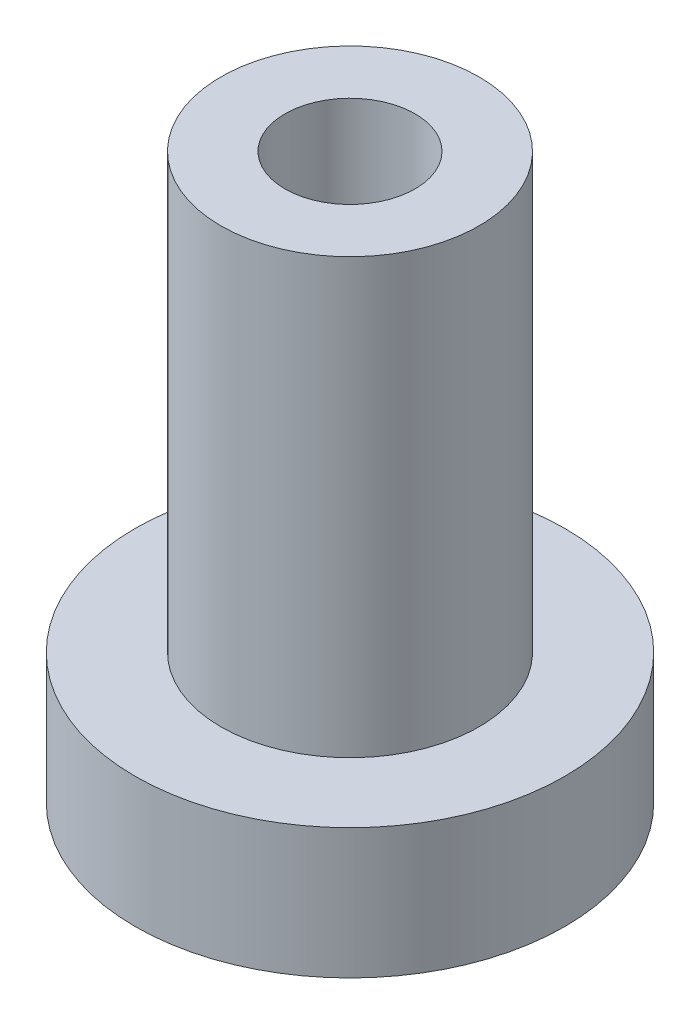
ISO-10303-21;
HEADER;
FILE_DESCRIPTION(('STEP AP214'),'2;1');
FILE_NAME('part.step','',(''),(''),'','','');
FILE_SCHEMA(('AUTOMOTIVE_DESIGN { 1 0 10303 214 1 1 1 1 }'));
ENDSEC;
DATA;
#1=APPLICATION_CONTEXT('core data for automotive mechanical design processes');
#2=APPLICATION_PROTOCOL_DEFINITION('international standard','automotive_design',2000,#1);
#3=PRODUCT_CONTEXT('',#1,'mechanical');
#4=PRODUCT('Part','Part','',(#3));
#5=PRODUCT_RELATED_PRODUCT_CATEGORY('part','',(#4));
#6=PRODUCT_DEFINITION_FORMATION('','',#4);
#7=PRODUCT_DEFINITION_CONTEXT('part definition',#1,'design');
#8=PRODUCT_DEFINITION('design','',#6,#7);
#9=PRODUCT_DEFINITION_SHAPE('','',#8);
#10=(LENGTH_UNIT() NAMED_UNIT(*) SI_UNIT(.MILLI.,.METRE.));
#11=(NAMED_UNIT(*) PLANE_ANGLE_UNIT() SI_UNIT($,.RADIAN.));
#12=(NAMED_UNIT(*) SI_UNIT($,.STERADIAN.) SOLID_ANGLE_UNIT());
#13=UNCERTAINTY_MEASURE_WITH_UNIT(LENGTH_MEASURE(1.E-05),#10,'distance_accuracy_value','');
#14=(GEOMETRIC_REPRESENTATION_CONTEXT(3) GLOBAL_UNCERTAINTY_ASSIGNED_CONTEXT((#13)) GLOBAL_UNIT_ASSIGNED_CONTEXT((#10,
#11,#12)) REPRESENTATION_CONTEXT('',''));
#15=CARTESIAN_POINT('',(0.,0.,0.));
#16=DIRECTION('',(0.,0.,1.));
#17=DIRECTION('',(1.,0.,0.));
#18=AXIS2_PLACEMENT_3D('',#15,#16,#17);
#19=CARTESIAN_POINT('',(0.,6.,0.));
#20=DIRECTION('',(0.,-1.,0.));
#21=DIRECTION('',(0.,0.,-1.));
#22=AXIS2_PLACEMENT_3D('',#19,#20,#21);
#23=CYLINDRICAL_SURFACE('',#22,9.9);
#24=CARTESIAN_POINT('',(0.,6.,0.));
#25=DIRECTION('',(0.,1.,0.));
#26=DIRECTION('',(0.,0.,1.));
#27=AXIS2_PLACEMENT_3D('',#24,#25,#26);
#28=CIRCLE('',#27,9.9);
#29=CARTESIAN_POINT('',(0.,6.,9.9));
#30=VERTEX_POINT('',#29);
#31=EDGE_CURVE('E38',#30,#30,#28,.T.);
#32=ORIENTED_EDGE('',*,*,#31,.F.);
#33=EDGE_LOOP('',(#32));
#34=FACE_BOUND('',#33,.T.);
#35=CARTESIAN_POINT('',(0.,0.,0.));
#36=DIRECTION('',(0.,1.,0.));
#37=DIRECTION('',(0.,0.,1.));
#38=AXIS2_PLACEMENT_3D('',#35,#36,#37);
#39=CIRCLE('',#38,9.9);
#40=CARTESIAN_POINT('',(0.,0.,9.9));
#41=VERTEX_POINT('',#40);
#42=EDGE_CURVE('E34',#41,#41,#39,.T.);
#43=ORIENTED_EDGE('',*,*,#42,.T.);
#44=EDGE_LOOP('',(#43));
#45=FACE_BOUND('',#44,.T.);
#46=ADVANCED_FACE('F31',(#34,#45),#23,.T.);
#47=CARTESIAN_POINT('',(0.,6.,0.));
#48=DIRECTION('',(0.,1.,0.));
#49=DIRECTION('',(0.,0.,1.));
#50=AXIS2_PLACEMENT_3D('',#47,#48,#49);
#51=PLANE('',#50);
#52=CARTESIAN_POINT('',(0.,6.,0.));
#53=DIRECTION('',(0.,1.,0.));
#54=DIRECTION('',(0.,0.,1.));
#55=AXIS2_PLACEMENT_3D('',#52,#53,#54);
#56=CIRCLE('',#55,5.95);
#57=CARTESIAN_POINT('',(0.,6.,5.95));
#58=VERTEX_POINT('',#57);
#59=EDGE_CURVE('E10',#58,#58,#56,.T.);
#60=ORIENTED_EDGE('',*,*,#59,.F.);
#61=EDGE_LOOP('',(#60));
#62=FACE_BOUND('',#61,.T.);
#63=ORIENTED_EDGE('',*,*,#31,.T.);
#64=EDGE_LOOP('',(#63));
#65=FACE_BOUND('',#64,.T.);
#66=ADVANCED_FACE('F70',(#62,#65),#51,.T.);
#67=CARTESIAN_POINT('',(0.,0.,0.));
#68=DIRECTION('',(0.,1.,0.));
#69=DIRECTION('',(0.,0.,1.));
#70=AXIS2_PLACEMENT_3D('',#67,#68,#69);
#71=PLANE('',#70);
#72=CARTESIAN_POINT('',(0.,0.,0.));
#73=DIRECTION('',(0.,1.,0.));
#74=DIRECTION('',(0.,0.,1.));
#75=AXIS2_PLACEMENT_3D('',#72,#73,#74);
#76=CIRCLE('',#75,3.);
#77=CARTESIAN_POINT('',(0.,0.,3.));
#78=VERTEX_POINT('',#77);
#79=EDGE_CURVE('E47',#78,#78,#76,.T.);
#80=ORIENTED_EDGE('',*,*,#79,.T.);
#81=EDGE_LOOP('',(#80));
#82=FACE_BOUND('',#81,.T.);
#83=ORIENTED_EDGE('',*,*,#42,.F.);
#84=EDGE_LOOP('',(#83));
#85=FACE_BOUND('',#84,.T.);
#86=ADVANCED_FACE('F65',(#82,#85),#71,.F.);
#87=CARTESIAN_POINT('',(0.,26.,0.));
#88=DIRECTION('',(0.,-1.,0.));
#89=DIRECTION('',(0.,0.,-1.));
#90=AXIS2_PLACEMENT_3D('',#87,#88,#89);
#91=CYLINDRICAL_SURFACE('',#90,5.95);
#92=CARTESIAN_POINT('',(0.,26.,0.));
#93=DIRECTION('',(0.,1.,0.));
#94=DIRECTION('',(0.,0.,1.));
#95=AXIS2_PLACEMENT_3D('',#92,#93,#94);
#96=CIRCLE('',#95,5.95);
#97=CARTESIAN_POINT('',(0.,26.,5.95));
#98=VERTEX_POINT('',#97);
#99=EDGE_CURVE('E44',#98,#98,#96,.T.);
#100=ORIENTED_EDGE('',*,*,#99,.F.);
#101=EDGE_LOOP('',(#100));
#102=FACE_BOUND('',#101,.T.);
#103=ORIENTED_EDGE('',*,*,#59,.T.);
#104=EDGE_LOOP('',(#103));
#105=FACE_BOUND('',#104,.T.);
#106=ADVANCED_FACE('F60',(#102,#105),#91,.T.);
#107=CARTESIAN_POINT('',(0.,26.,0.));
#108=DIRECTION('',(0.,1.,0.));
#109=DIRECTION('',(0.,0.,1.));
#110=AXIS2_PLACEMENT_3D('',#107,#108,#109);
#111=PLANE('',#110);
#112=CARTESIAN_POINT('',(0.,26.,0.));
#113=DIRECTION('',(0.,1.,0.));
#114=DIRECTION('',(0.,0.,1.));
#115=AXIS2_PLACEMENT_3D('',#112,#113,#114);
#116=CIRCLE('',#115,3.);
#117=CARTESIAN_POINT('',(0.,26.,3.));
#118=VERTEX_POINT('',#117);
#119=EDGE_CURVE('E50',#118,#118,#116,.T.);
#120=ORIENTED_EDGE('',*,*,#119,.F.);
#121=EDGE_LOOP('',(#120));
#122=FACE_BOUND('',#121,.T.);
#123=ORIENTED_EDGE('',*,*,#99,.T.);
#124=EDGE_LOOP('',(#123));
#125=FACE_BOUND('',#124,.T.);
#126=ADVANCED_FACE('F57',(#122,#125),#111,.T.);
#127=CARTESIAN_POINT('',(0.,-9.00000000000001,0.));
#128=DIRECTION('',(0.,1.,0.));
#129=DIRECTION('',(0.,0.,1.));
#130=AXIS2_PLACEMENT_3D('',#127,#128,#129);
#131=CYLINDRICAL_SURFACE('',#130,3.);
#132=ORIENTED_EDGE('',*,*,#119,.T.);
#133=EDGE_LOOP('',(#132));
#134=FACE_BOUND('',#133,.T.);
#135=ORIENTED_EDGE('',*,*,#79,.F.);
#136=EDGE_LOOP('',(#135));
#137=FACE_BOUND('',#136,.T.);
#138=ADVANCED_FACE('F54',(#134,#137),#131,.F.);
#139=CLOSED_SHELL('',(#46,#66,#86,#106,#126,#138));
#140=MANIFOLD_SOLID_BREP('B2',#139);
#141=ADVANCED_BREP_SHAPE_REPRESENTATION('',(#18,#140),#14);
#142=SHAPE_DEFINITION_REPRESENTATION(#9,#141);
ENDSEC;
END-ISO-10303-21;
